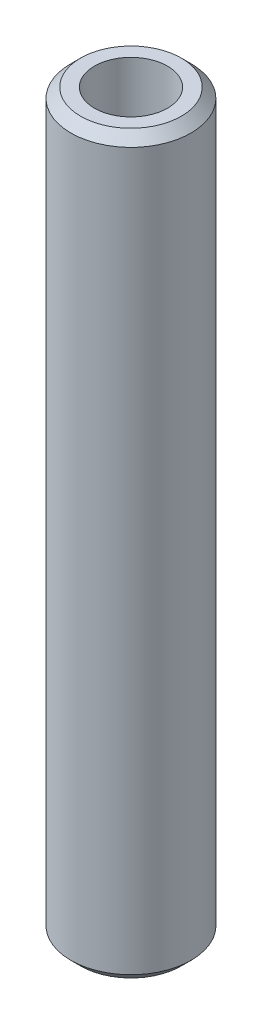
ISO-10303-21;
HEADER;
FILE_DESCRIPTION(('STEP AP214'),'2;1');
FILE_NAME('part.step','',(''),(''),'','','');
FILE_SCHEMA(('AUTOMOTIVE_DESIGN { 1 0 10303 214 1 1 1 1 }'));
ENDSEC;
DATA;
#1=APPLICATION_CONTEXT('core data for automotive mechanical design processes');
#2=APPLICATION_PROTOCOL_DEFINITION('international standard','automotive_design',2000,#1);
#3=PRODUCT_CONTEXT('',#1,'mechanical');
#4=PRODUCT('Part','Part','',(#3));
#5=PRODUCT_RELATED_PRODUCT_CATEGORY('part','',(#4));
#6=PRODUCT_DEFINITION_FORMATION('','',#4);
#7=PRODUCT_DEFINITION_CONTEXT('part definition',#1,'design');
#8=PRODUCT_DEFINITION('design','',#6,#7);
#9=PRODUCT_DEFINITION_SHAPE('','',#8);
#10=(LENGTH_UNIT() NAMED_UNIT(*) SI_UNIT(.MILLI.,.METRE.));
#11=(NAMED_UNIT(*) PLANE_ANGLE_UNIT() SI_UNIT($,.RADIAN.));
#12=(NAMED_UNIT(*) SI_UNIT($,.STERADIAN.) SOLID_ANGLE_UNIT());
#13=UNCERTAINTY_MEASURE_WITH_UNIT(LENGTH_MEASURE(1.E-05),#10,'distance_accuracy_value','');
#14=(GEOMETRIC_REPRESENTATION_CONTEXT(3) GLOBAL_UNCERTAINTY_ASSIGNED_CONTEXT((#13)) GLOBAL_UNIT_ASSIGNED_CONTEXT((#10,
#11,#12)) REPRESENTATION_CONTEXT('',''));
#15=CARTESIAN_POINT('',(0.,0.,0.));
#16=DIRECTION('',(0.,0.,1.));
#17=DIRECTION('',(1.,0.,0.));
#18=AXIS2_PLACEMENT_3D('',#15,#16,#17);
#19=CARTESIAN_POINT('',(0.,428.614481659674,0.));
#20=DIRECTION('',(0.,-1.,0.));
#21=DIRECTION('',(0.,0.,-1.));
#22=AXIS2_PLACEMENT_3D('',#19,#20,#21);
#23=CYLINDRICAL_SURFACE('',#22,35.);
#24=CARTESIAN_POINT('',(0.,422.96299743494,0.));
#25=DIRECTION('',(0.,1.,0.));
#26=DIRECTION('',(0.,0.,1.));
#27=AXIS2_PLACEMENT_3D('',#24,#25,#26);
#28=CIRCLE('',#27,35.);
#29=CARTESIAN_POINT('',(0.,422.96299743494,35.));
#30=VERTEX_POINT('',#29);
#31=EDGE_CURVE('E50',#30,#30,#28,.F.);
#32=ORIENTED_EDGE('',*,*,#31,.T.);
#33=EDGE_LOOP('',(#32));
#34=FACE_BOUND('',#33,.T.);
#35=CARTESIAN_POINT('',(0.,5.65148422473477,0.));
#36=DIRECTION('',(0.,1.,0.));
#37=DIRECTION('',(0.,0.,1.));
#38=AXIS2_PLACEMENT_3D('',#35,#36,#37);
#39=CIRCLE('',#38,35.);
#40=CARTESIAN_POINT('',(0.,5.65148422473477,35.));
#41=VERTEX_POINT('',#40);
#42=EDGE_CURVE('E51',#41,#41,#39,.T.);
#43=ORIENTED_EDGE('',*,*,#42,.T.);
#44=EDGE_LOOP('',(#43));
#45=FACE_BOUND('',#44,.T.);
#46=ADVANCED_FACE('F39',(#34,#45),#23,.T.);
#47=CARTESIAN_POINT('',(0.,428.614481659674,0.));
#48=DIRECTION('',(0.,1.,0.));
#49=DIRECTION('',(0.,0.,1.));
#50=AXIS2_PLACEMENT_3D('',#47,#48,#49);
#51=PLANE('',#50);
#52=CARTESIAN_POINT('',(0.,428.614481659674,0.));
#53=DIRECTION('',(0.,1.,0.));
#54=DIRECTION('',(0.,0.,1.));
#55=AXIS2_PLACEMENT_3D('',#52,#53,#54);
#56=CIRCLE('',#55,29.3485157752653);
#57=CARTESIAN_POINT('',(0.,428.614481659674,29.3485157752653));
#58=VERTEX_POINT('',#57);
#59=EDGE_CURVE('E54',#58,#58,#56,.T.);
#60=ORIENTED_EDGE('',*,*,#59,.T.);
#61=EDGE_LOOP('',(#60));
#62=FACE_BOUND('',#61,.T.);
#63=CARTESIAN_POINT('',(0.,428.614481659674,0.));
#64=DIRECTION('',(0.,1.,0.));
#65=DIRECTION('',(0.,0.,1.));
#66=AXIS2_PLACEMENT_3D('',#63,#64,#65);
#67=CIRCLE('',#66,21.2778769841294);
#68=CARTESIAN_POINT('',(0.,428.614481659674,21.2778769841294));
#69=VERTEX_POINT('',#68);
#70=EDGE_CURVE('E58',#69,#69,#67,.T.);
#71=ORIENTED_EDGE('',*,*,#70,.F.);
#72=EDGE_LOOP('',(#71));
#73=FACE_BOUND('',#72,.T.);
#74=ADVANCED_FACE('F69',(#62,#73),#51,.T.);
#75=CARTESIAN_POINT('',(0.,0.,0.));
#76=DIRECTION('',(0.,1.,0.));
#77=DIRECTION('',(0.,0.,1.));
#78=AXIS2_PLACEMENT_3D('',#75,#76,#77);
#79=PLANE('',#78);
#80=CARTESIAN_POINT('',(0.,0.,0.));
#81=DIRECTION('',(0.,1.,0.));
#82=DIRECTION('',(0.,0.,1.));
#83=AXIS2_PLACEMENT_3D('',#80,#81,#82);
#84=CIRCLE('',#83,29.3485157752652);
#85=CARTESIAN_POINT('',(0.,0.,29.3485157752652));
#86=VERTEX_POINT('',#85);
#87=EDGE_CURVE('E10',#86,#86,#84,.F.);
#88=ORIENTED_EDGE('',*,*,#87,.T.);
#89=EDGE_LOOP('',(#88));
#90=FACE_BOUND('',#89,.T.);
#91=CARTESIAN_POINT('',(0.,0.,0.));
#92=DIRECTION('',(0.,1.,0.));
#93=DIRECTION('',(0.,0.,1.));
#94=AXIS2_PLACEMENT_3D('',#91,#92,#93);
#95=CIRCLE('',#94,21.2778769841294);
#96=CARTESIAN_POINT('',(0.,0.,21.2778769841294));
#97=VERTEX_POINT('',#96);
#98=EDGE_CURVE('E63',#97,#97,#95,.T.);
#99=ORIENTED_EDGE('',*,*,#98,.T.);
#100=EDGE_LOOP('',(#99));
#101=FACE_BOUND('',#100,.T.);
#102=ADVANCED_FACE('F75',(#90,#101),#79,.F.);
#103=CARTESIAN_POINT('',(0.,428.614481659674,0.));
#104=DIRECTION('',(0.,-1.,0.));
#105=DIRECTION('',(0.,0.,-1.));
#106=AXIS2_PLACEMENT_3D('',#103,#104,#105);
#107=CYLINDRICAL_SURFACE('',#106,21.2778769841294);
#108=ORIENTED_EDGE('',*,*,#70,.T.);
#109=EDGE_LOOP('',(#108));
#110=FACE_BOUND('',#109,.T.);
#111=ORIENTED_EDGE('',*,*,#98,.F.);
#112=EDGE_LOOP('',(#111));
#113=FACE_BOUND('',#112,.T.);
#114=ADVANCED_FACE('F70',(#110,#113),#107,.F.);
#115=CARTESIAN_POINT('',(0.,428.614481659674,0.));
#116=DIRECTION('',(0.,-1.,0.));
#117=DIRECTION('',(0.,0.,-1.));
#118=AXIS2_PLACEMENT_3D('',#115,#116,#117);
#119=CONICAL_SURFACE('',#118,29.3485157752653,0.785398163397447);
#120=ORIENTED_EDGE('',*,*,#31,.F.);
#121=EDGE_LOOP('',(#120));
#122=FACE_BOUND('',#121,.T.);
#123=ORIENTED_EDGE('',*,*,#59,.F.);
#124=EDGE_LOOP('',(#123));
#125=FACE_BOUND('',#124,.T.);
#126=ADVANCED_FACE('F81',(#122,#125),#119,.T.);
#127=CARTESIAN_POINT('',(0.,5.65148422473477,0.));
#128=DIRECTION('',(0.,1.,0.));
#129=DIRECTION('',(0.,0.,1.));
#130=AXIS2_PLACEMENT_3D('',#127,#128,#129);
#131=CONICAL_SURFACE('',#130,35.,0.785398163397451);
#132=ORIENTED_EDGE('',*,*,#87,.F.);
#133=EDGE_LOOP('',(#132));
#134=FACE_BOUND('',#133,.T.);
#135=ORIENTED_EDGE('',*,*,#42,.F.);
#136=EDGE_LOOP('',(#135));
#137=FACE_BOUND('',#136,.T.);
#138=ADVANCED_FACE('F45',(#134,#137),#131,.T.);
#139=CLOSED_SHELL('',(#46,#74,#102,#114,#126,#138));
#140=MANIFOLD_SOLID_BREP('B2',#139);
#141=ADVANCED_BREP_SHAPE_REPRESENTATION('',(#18,#140),#14);
#142=SHAPE_DEFINITION_REPRESENTATION(#9,#141);
ENDSEC;
END-ISO-10303-21;
